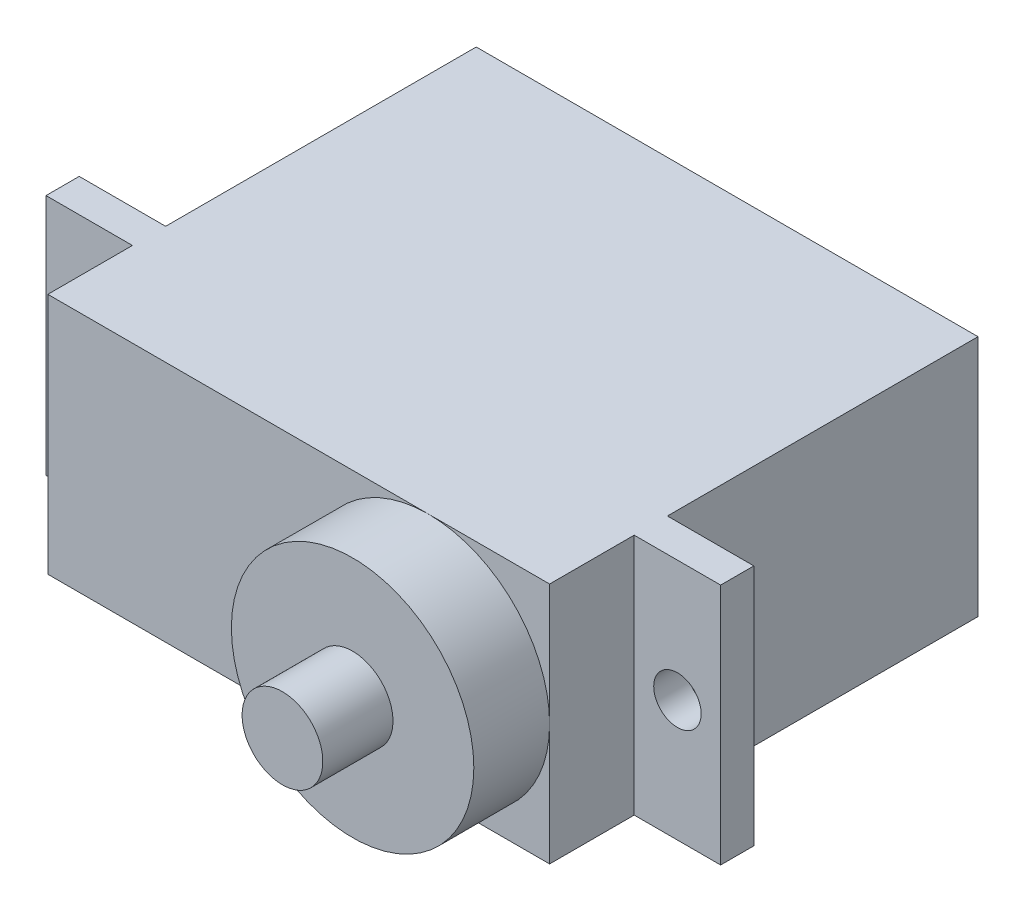
ISO-10303-21;
HEADER;
FILE_DESCRIPTION(('STEP AP214'),'2;1');
FILE_NAME('part.step','',(''),(''),'','','');
FILE_SCHEMA(('AUTOMOTIVE_DESIGN { 1 0 10303 214 1 1 1 1 }'));
ENDSEC;
DATA;
#1=APPLICATION_CONTEXT('core data for automotive mechanical design processes');
#2=APPLICATION_PROTOCOL_DEFINITION('international standard','automotive_design',2000,#1);
#3=PRODUCT_CONTEXT('',#1,'mechanical');
#4=PRODUCT('Part','Part','',(#3));
#5=PRODUCT_RELATED_PRODUCT_CATEGORY('part','',(#4));
#6=PRODUCT_DEFINITION_FORMATION('','',#4);
#7=PRODUCT_DEFINITION_CONTEXT('part definition',#1,'design');
#8=PRODUCT_DEFINITION('design','',#6,#7);
#9=PRODUCT_DEFINITION_SHAPE('','',#8);
#10=(LENGTH_UNIT() NAMED_UNIT(*) SI_UNIT(.MILLI.,.METRE.));
#11=(NAMED_UNIT(*) PLANE_ANGLE_UNIT() SI_UNIT($,.RADIAN.));
#12=(NAMED_UNIT(*) SI_UNIT($,.STERADIAN.) SOLID_ANGLE_UNIT());
#13=UNCERTAINTY_MEASURE_WITH_UNIT(LENGTH_MEASURE(1.E-05),#10,'distance_accuracy_value','');
#14=(GEOMETRIC_REPRESENTATION_CONTEXT(3) GLOBAL_UNCERTAINTY_ASSIGNED_CONTEXT((#13)) GLOBAL_UNIT_ASSIGNED_CONTEXT((#10,
#11,#12)) REPRESENTATION_CONTEXT('',''));
#15=CARTESIAN_POINT('',(0.,0.,0.));
#16=DIRECTION('',(0.,0.,1.));
#17=DIRECTION('',(1.,0.,0.));
#18=AXIS2_PLACEMENT_3D('',#15,#16,#17);
#19=CARTESIAN_POINT('',(0.,0.,20.32));
#20=DIRECTION('',(0.,0.,-1.));
#21=DIRECTION('',(-1.,0.,0.));
#22=AXIS2_PLACEMENT_3D('',#19,#20,#21);
#23=PLANE('',#22);
#24=CARTESIAN_POINT('',(6.15,0.,20.32));
#25=DIRECTION('',(0.,0.,1.));
#26=DIRECTION('',(1.,0.,0.));
#27=AXIS2_PLACEMENT_3D('',#24,#25,#26);
#28=CIRCLE('',#27,5.75);
#29=CARTESIAN_POINT('',(6.15,-5.75,20.32));
#30=VERTEX_POINT('',#29);
#31=CARTESIAN_POINT('',(11.9,0.,20.32));
#32=VERTEX_POINT('',#31);
#33=EDGE_CURVE('E158',#30,#32,#28,.T.);
#34=ORIENTED_EDGE('',*,*,#33,.F.);
#35=DIRECTION('',(1.,0.,0.));
#36=VECTOR('',#35,1.);
#37=CARTESIAN_POINT('',(-11.9,-5.75,20.32));
#38=LINE('',#37,#36);
#39=CARTESIAN_POINT('',(11.9,-5.75,20.32));
#40=VERTEX_POINT('',#39);
#41=EDGE_CURVE('E144',#30,#40,#38,.T.);
#42=ORIENTED_EDGE('',*,*,#41,.T.);
#43=DIRECTION('',(0.,1.,0.));
#44=VECTOR('',#43,1.);
#45=CARTESIAN_POINT('',(11.9,-5.75,20.32));
#46=LINE('',#45,#44);
#47=EDGE_CURVE('E156',#40,#32,#46,.T.);
#48=ORIENTED_EDGE('',*,*,#47,.T.);
#49=EDGE_LOOP('',(#34,#42,#48));
#50=FACE_BOUND('',#49,.T.);
#51=ADVANCED_FACE('F37',(#50),#23,.F.);
#52=CARTESIAN_POINT('',(6.15,5.75,20.32));
#53=VERTEX_POINT('',#52);
#54=EDGE_CURVE('E59',#32,#53,#28,.T.);
#55=ORIENTED_EDGE('',*,*,#54,.F.);
#56=CARTESIAN_POINT('',(11.9,5.75,20.32));
#57=VERTEX_POINT('',#56);
#58=EDGE_CURVE('E238',#32,#57,#46,.T.);
#59=ORIENTED_EDGE('',*,*,#58,.T.);
#60=DIRECTION('',(1.,0.,0.));
#61=VECTOR('',#60,1.);
#62=CARTESIAN_POINT('',(-11.9,5.75,20.32));
#63=LINE('',#62,#61);
#64=EDGE_CURVE('E233',#53,#57,#63,.T.);
#65=ORIENTED_EDGE('',*,*,#64,.F.);
#66=EDGE_LOOP('',(#55,#59,#65));
#67=FACE_BOUND('',#66,.T.);
#68=ADVANCED_FACE('F299',(#67),#23,.F.);
#69=CARTESIAN_POINT('',(-11.9,-5.75,20.32));
#70=DIRECTION('',(-1.,0.,0.));
#71=DIRECTION('',(0.,0.,1.));
#72=AXIS2_PLACEMENT_3D('',#69,#70,#71);
#73=PLANE('',#72);
#74=DIRECTION('',(0.,0.,-1.));
#75=VECTOR('',#74,1.);
#76=CARTESIAN_POINT('',(-11.9,-5.75,20.32));
#77=LINE('',#76,#75);
#78=CARTESIAN_POINT('',(-11.9,-5.75,14.732));
#79=VERTEX_POINT('',#78);
#80=CARTESIAN_POINT('',(-11.9,-5.75,0.));
#81=VERTEX_POINT('',#80);
#82=EDGE_CURVE('E250',#79,#81,#77,.T.);
#83=ORIENTED_EDGE('',*,*,#82,.F.);
#84=DIRECTION('',(0.,1.,0.));
#85=VECTOR('',#84,1.);
#86=CARTESIAN_POINT('',(-11.9,0.,14.732));
#87=LINE('',#86,#85);
#88=CARTESIAN_POINT('',(-11.9,5.75,14.732));
#89=VERTEX_POINT('',#88);
#90=EDGE_CURVE('E174',#79,#89,#87,.T.);
#91=ORIENTED_EDGE('',*,*,#90,.T.);
#92=DIRECTION('',(0.,0.,-1.));
#93=VECTOR('',#92,1.);
#94=CARTESIAN_POINT('',(-11.9,5.75,20.32));
#95=LINE('',#94,#93);
#96=CARTESIAN_POINT('',(-11.9,5.75,0.));
#97=VERTEX_POINT('',#96);
#98=EDGE_CURVE('E143',#89,#97,#95,.T.);
#99=ORIENTED_EDGE('',*,*,#98,.T.);
#100=DIRECTION('',(0.,1.,0.));
#101=VECTOR('',#100,1.);
#102=CARTESIAN_POINT('',(-11.9,-5.75,0.));
#103=LINE('',#102,#101);
#104=EDGE_CURVE('E230',#81,#97,#103,.T.);
#105=ORIENTED_EDGE('',*,*,#104,.F.);
#106=EDGE_LOOP('',(#83,#91,#99,#105));
#107=FACE_BOUND('',#106,.T.);
#108=ADVANCED_FACE('F262',(#107),#73,.T.);
#109=CARTESIAN_POINT('',(11.9,-5.75,20.32));
#110=DIRECTION('',(-1.,0.,0.));
#111=DIRECTION('',(0.,0.,1.));
#112=AXIS2_PLACEMENT_3D('',#109,#110,#111);
#113=PLANE('',#112);
#114=DIRECTION('',(0.,1.,0.));
#115=VECTOR('',#114,1.);
#116=CARTESIAN_POINT('',(11.9,0.,14.732));
#117=LINE('',#116,#115);
#118=CARTESIAN_POINT('',(11.9,-5.75,14.732));
#119=VERTEX_POINT('',#118);
#120=CARTESIAN_POINT('',(11.9,5.75,14.732));
#121=VERTEX_POINT('',#120);
#122=EDGE_CURVE('E224',#119,#121,#117,.T.);
#123=ORIENTED_EDGE('',*,*,#122,.F.);
#124=DIRECTION('',(0.,0.,-1.));
#125=VECTOR('',#124,1.);
#126=CARTESIAN_POINT('',(11.9,-5.75,20.32));
#127=LINE('',#126,#125);
#128=CARTESIAN_POINT('',(11.9,-5.75,0.));
#129=VERTEX_POINT('',#128);
#130=EDGE_CURVE('E252',#119,#129,#127,.T.);
#131=ORIENTED_EDGE('',*,*,#130,.T.);
#132=DIRECTION('',(0.,1.,0.));
#133=VECTOR('',#132,1.);
#134=CARTESIAN_POINT('',(11.9,-5.75,0.));
#135=LINE('',#134,#133);
#136=CARTESIAN_POINT('',(11.9,5.75,0.));
#137=VERTEX_POINT('',#136);
#138=EDGE_CURVE('E245',#129,#137,#135,.T.);
#139=ORIENTED_EDGE('',*,*,#138,.T.);
#140=DIRECTION('',(0.,0.,-1.));
#141=VECTOR('',#140,1.);
#142=CARTESIAN_POINT('',(11.9,5.75,20.32));
#143=LINE('',#142,#141);
#144=EDGE_CURVE('E255',#121,#137,#143,.T.);
#145=ORIENTED_EDGE('',*,*,#144,.F.);
#146=EDGE_LOOP('',(#123,#131,#139,#145));
#147=FACE_BOUND('',#146,.T.);
#148=ADVANCED_FACE('F289',(#147),#113,.F.);
#149=DIRECTION('',(0.,1.,0.));
#150=VECTOR('',#149,1.);
#151=CARTESIAN_POINT('',(-11.9,0.,16.3068));
#152=LINE('',#151,#150);
#153=CARTESIAN_POINT('',(-11.9,-5.75,16.3068));
#154=VERTEX_POINT('',#153);
#155=CARTESIAN_POINT('',(-11.9,5.75,16.3068));
#156=VERTEX_POINT('',#155);
#157=EDGE_CURVE('E181',#154,#156,#152,.T.);
#158=ORIENTED_EDGE('',*,*,#157,.F.);
#159=CARTESIAN_POINT('',(-11.9,-5.75,20.32));
#160=VERTEX_POINT('',#159);
#161=EDGE_CURVE('E45',#160,#154,#77,.T.);
#162=ORIENTED_EDGE('',*,*,#161,.F.);
#163=DIRECTION('',(0.,1.,0.));
#164=VECTOR('',#163,1.);
#165=CARTESIAN_POINT('',(-11.9,-5.75,20.32));
#166=LINE('',#165,#164);
#167=CARTESIAN_POINT('',(-11.9,5.75,20.32));
#168=VERTEX_POINT('',#167);
#169=EDGE_CURVE('E140',#160,#168,#166,.T.);
#170=ORIENTED_EDGE('',*,*,#169,.T.);
#171=EDGE_CURVE('E256',#168,#156,#95,.T.);
#172=ORIENTED_EDGE('',*,*,#171,.T.);
#173=EDGE_LOOP('',(#158,#162,#170,#172));
#174=FACE_BOUND('',#173,.T.);
#175=ADVANCED_FACE('F39',(#174),#73,.T.);
#176=CARTESIAN_POINT('',(-11.9,-5.75,20.32));
#177=DIRECTION('',(0.,1.,0.));
#178=DIRECTION('',(0.,0.,1.));
#179=AXIS2_PLACEMENT_3D('',#176,#177,#178);
#180=PLANE('',#179);
#181=DIRECTION('',(1.,0.,0.));
#182=VECTOR('',#181,1.);
#183=CARTESIAN_POINT('',(-11.9,-5.75,0.));
#184=LINE('',#183,#182);
#185=EDGE_CURVE('E234',#81,#129,#184,.T.);
#186=ORIENTED_EDGE('',*,*,#185,.T.);
#187=ORIENTED_EDGE('',*,*,#130,.F.);
#188=DIRECTION('',(-1.,0.,0.));
#189=VECTOR('',#188,1.);
#190=CARTESIAN_POINT('',(0.,-5.75,14.732));
#191=LINE('',#190,#189);
#192=CARTESIAN_POINT('',(16.,-5.75,14.732));
#193=VERTEX_POINT('',#192);
#194=EDGE_CURVE('E222',#193,#119,#191,.T.);
#195=ORIENTED_EDGE('',*,*,#194,.F.);
#196=DIRECTION('',(0.,0.,-1.));
#197=VECTOR('',#196,1.);
#198=CARTESIAN_POINT('',(16.,-5.75,16.3068));
#199=LINE('',#198,#197);
#200=CARTESIAN_POINT('',(16.,-5.75,16.3068));
#201=VERTEX_POINT('',#200);
#202=EDGE_CURVE('E216',#201,#193,#199,.T.);
#203=ORIENTED_EDGE('',*,*,#202,.F.);
#204=DIRECTION('',(-1.,0.,0.));
#205=VECTOR('',#204,1.);
#206=CARTESIAN_POINT('',(0.,-5.75,16.3068));
#207=LINE('',#206,#205);
#208=CARTESIAN_POINT('',(11.9,-5.75,16.3068));
#209=VERTEX_POINT('',#208);
#210=EDGE_CURVE('E208',#201,#209,#207,.T.);
#211=ORIENTED_EDGE('',*,*,#210,.T.);
#212=EDGE_CURVE('E152',#40,#209,#127,.T.);
#213=ORIENTED_EDGE('',*,*,#212,.F.);
#214=ORIENTED_EDGE('',*,*,#41,.F.);
#215=EDGE_CURVE('E136',#160,#30,#38,.T.);
#216=ORIENTED_EDGE('',*,*,#215,.F.);
#217=ORIENTED_EDGE('',*,*,#161,.T.);
#218=DIRECTION('',(1.,0.,0.));
#219=VECTOR('',#218,1.);
#220=CARTESIAN_POINT('',(0.,-5.75,16.3068));
#221=LINE('',#220,#219);
#222=CARTESIAN_POINT('',(-16.,-5.75,16.3068));
#223=VERTEX_POINT('',#222);
#224=EDGE_CURVE('E173',#223,#154,#221,.T.);
#225=ORIENTED_EDGE('',*,*,#224,.F.);
#226=DIRECTION('',(0.,0.,-1.));
#227=VECTOR('',#226,1.);
#228=CARTESIAN_POINT('',(-16.,-5.75,16.3068));
#229=LINE('',#228,#227);
#230=CARTESIAN_POINT('',(-16.,-5.75,14.732));
#231=VERTEX_POINT('',#230);
#232=EDGE_CURVE('E184',#223,#231,#229,.T.);
#233=ORIENTED_EDGE('',*,*,#232,.T.);
#234=DIRECTION('',(1.,0.,0.));
#235=VECTOR('',#234,1.);
#236=CARTESIAN_POINT('',(0.,-5.75,14.732));
#237=LINE('',#236,#235);
#238=EDGE_CURVE('E187',#231,#79,#237,.T.);
#239=ORIENTED_EDGE('',*,*,#238,.T.);
#240=ORIENTED_EDGE('',*,*,#82,.T.);
#241=EDGE_LOOP('',(#186,#187,#195,#203,#211,#213,#214,#216,#217,#225,#233,#239,#240));
#242=FACE_BOUND('',#241,.T.);
#243=ADVANCED_FACE('F149',(#242),#180,.F.);
#244=ORIENTED_EDGE('',*,*,#212,.T.);
#245=DIRECTION('',(0.,1.,0.));
#246=VECTOR('',#245,1.);
#247=CARTESIAN_POINT('',(11.9,0.,16.3068));
#248=LINE('',#247,#246);
#249=CARTESIAN_POINT('',(11.9,5.75,16.3068));
#250=VERTEX_POINT('',#249);
#251=EDGE_CURVE('E210',#209,#250,#248,.T.);
#252=ORIENTED_EDGE('',*,*,#251,.T.);
#253=EDGE_CURVE('E253',#57,#250,#143,.T.);
#254=ORIENTED_EDGE('',*,*,#253,.F.);
#255=ORIENTED_EDGE('',*,*,#58,.F.);
#256=ORIENTED_EDGE('',*,*,#47,.F.);
#257=EDGE_LOOP('',(#244,#252,#254,#255,#256));
#258=FACE_BOUND('',#257,.T.);
#259=ADVANCED_FACE('F294',(#258),#113,.F.);
#260=CARTESIAN_POINT('',(-11.9,5.75,20.32));
#261=DIRECTION('',(0.,1.,0.));
#262=DIRECTION('',(0.,0.,1.));
#263=AXIS2_PLACEMENT_3D('',#260,#261,#262);
#264=PLANE('',#263);
#265=DIRECTION('',(1.,0.,0.));
#266=VECTOR('',#265,1.);
#267=CARTESIAN_POINT('',(-11.9,5.75,0.));
#268=LINE('',#267,#266);
#269=EDGE_CURVE('E242',#97,#137,#268,.T.);
#270=ORIENTED_EDGE('',*,*,#269,.F.);
#271=ORIENTED_EDGE('',*,*,#98,.F.);
#272=DIRECTION('',(-1.,0.,0.));
#273=VECTOR('',#272,1.);
#274=CARTESIAN_POINT('',(0.,5.75000000000001,14.732));
#275=LINE('',#274,#273);
#276=CARTESIAN_POINT('',(-16.,5.75,14.732));
#277=VERTEX_POINT('',#276);
#278=EDGE_CURVE('E192',#89,#277,#275,.T.);
#279=ORIENTED_EDGE('',*,*,#278,.T.);
#280=DIRECTION('',(0.,0.,-1.));
#281=VECTOR('',#280,1.);
#282=CARTESIAN_POINT('',(-16.,5.75,16.3068));
#283=LINE('',#282,#281);
#284=CARTESIAN_POINT('',(-16.,5.75,16.3068));
#285=VERTEX_POINT('',#284);
#286=EDGE_CURVE('E195',#285,#277,#283,.T.);
#287=ORIENTED_EDGE('',*,*,#286,.F.);
#288=DIRECTION('',(-1.,0.,0.));
#289=VECTOR('',#288,1.);
#290=CARTESIAN_POINT('',(0.,5.75000000000001,16.3068));
#291=LINE('',#290,#289);
#292=EDGE_CURVE('E179',#156,#285,#291,.T.);
#293=ORIENTED_EDGE('',*,*,#292,.F.);
#294=ORIENTED_EDGE('',*,*,#171,.F.);
#295=EDGE_CURVE('E235',#168,#53,#63,.T.);
#296=ORIENTED_EDGE('',*,*,#295,.T.);
#297=ORIENTED_EDGE('',*,*,#64,.T.);
#298=ORIENTED_EDGE('',*,*,#253,.T.);
#299=DIRECTION('',(1.,0.,0.));
#300=VECTOR('',#299,1.);
#301=CARTESIAN_POINT('',(0.,5.75000000000001,16.3068));
#302=LINE('',#301,#300);
#303=CARTESIAN_POINT('',(16.,5.75,16.3068));
#304=VERTEX_POINT('',#303);
#305=EDGE_CURVE('E213',#250,#304,#302,.T.);
#306=ORIENTED_EDGE('',*,*,#305,.T.);
#307=DIRECTION('',(0.,0.,-1.));
#308=VECTOR('',#307,1.);
#309=CARTESIAN_POINT('',(16.,5.75,16.3068));
#310=LINE('',#309,#308);
#311=CARTESIAN_POINT('',(16.,5.75,14.732));
#312=VERTEX_POINT('',#311);
#313=EDGE_CURVE('E228',#304,#312,#310,.T.);
#314=ORIENTED_EDGE('',*,*,#313,.T.);
#315=DIRECTION('',(1.,0.,0.));
#316=VECTOR('',#315,1.);
#317=CARTESIAN_POINT('',(0.,5.75000000000001,14.732));
#318=LINE('',#317,#316);
#319=EDGE_CURVE('E205',#121,#312,#318,.T.);
#320=ORIENTED_EDGE('',*,*,#319,.F.);
#321=ORIENTED_EDGE('',*,*,#144,.T.);
#322=EDGE_LOOP('',(#270,#271,#279,#287,#293,#294,#296,#297,#298,#306,#314,#320,#321));
#323=FACE_BOUND('',#322,.T.);
#324=ADVANCED_FACE('F266',(#323),#264,.T.);
#325=EDGE_CURVE('E52',#53,#30,#28,.T.);
#326=ORIENTED_EDGE('',*,*,#325,.F.);
#327=ORIENTED_EDGE('',*,*,#295,.F.);
#328=ORIENTED_EDGE('',*,*,#169,.F.);
#329=ORIENTED_EDGE('',*,*,#215,.T.);
#330=EDGE_LOOP('',(#326,#327,#328,#329));
#331=FACE_BOUND('',#330,.T.);
#332=ADVANCED_FACE('F138',(#331),#23,.F.);
#333=CARTESIAN_POINT('',(0.,0.,0.));
#334=DIRECTION('',(0.,0.,-1.));
#335=DIRECTION('',(-1.,0.,0.));
#336=AXIS2_PLACEMENT_3D('',#333,#334,#335);
#337=PLANE('',#336);
#338=ORIENTED_EDGE('',*,*,#104,.T.);
#339=ORIENTED_EDGE('',*,*,#269,.T.);
#340=ORIENTED_EDGE('',*,*,#138,.F.);
#341=ORIENTED_EDGE('',*,*,#185,.F.);
#342=EDGE_LOOP('',(#338,#339,#340,#341));
#343=FACE_BOUND('',#342,.T.);
#344=ADVANCED_FACE('F272',(#343),#337,.T.);
#345=CARTESIAN_POINT('',(16.,0.,16.3068));
#346=DIRECTION('',(1.,0.,0.));
#347=DIRECTION('',(0.,0.,-1.));
#348=AXIS2_PLACEMENT_3D('',#345,#346,#347);
#349=PLANE('',#348);
#350=DIRECTION('',(0.,-1.,0.));
#351=VECTOR('',#350,1.);
#352=CARTESIAN_POINT('',(16.,0.,14.732));
#353=LINE('',#352,#351);
#354=EDGE_CURVE('E219',#312,#193,#353,.T.);
#355=ORIENTED_EDGE('',*,*,#354,.F.);
#356=ORIENTED_EDGE('',*,*,#313,.F.);
#357=DIRECTION('',(0.,-1.,0.));
#358=VECTOR('',#357,1.);
#359=CARTESIAN_POINT('',(16.,0.,16.3068));
#360=LINE('',#359,#358);
#361=EDGE_CURVE('E204',#304,#201,#360,.T.);
#362=ORIENTED_EDGE('',*,*,#361,.T.);
#363=ORIENTED_EDGE('',*,*,#202,.T.);
#364=EDGE_LOOP('',(#355,#356,#362,#363));
#365=FACE_BOUND('',#364,.T.);
#366=ADVANCED_FACE('F312',(#365),#349,.T.);
#367=CARTESIAN_POINT('',(13.95,0.,16.3068));
#368=DIRECTION('',(0.,0.,-1.));
#369=DIRECTION('',(-1.,0.,0.));
#370=AXIS2_PLACEMENT_3D('',#367,#368,#369);
#371=CYLINDRICAL_SURFACE('',#370,1.125);
#372=CARTESIAN_POINT('',(13.95,0.,16.3068));
#373=DIRECTION('',(0.,0.,-1.));
#374=DIRECTION('',(-1.,0.,0.));
#375=AXIS2_PLACEMENT_3D('',#372,#373,#374);
#376=CIRCLE('',#375,1.125);
#377=CARTESIAN_POINT('',(12.825,0.,16.3068));
#378=VERTEX_POINT('',#377);
#379=EDGE_CURVE('E201',#378,#378,#376,.T.);
#380=ORIENTED_EDGE('',*,*,#379,.F.);
#381=EDGE_LOOP('',(#380));
#382=FACE_BOUND('',#381,.T.);
#383=CARTESIAN_POINT('',(13.95,0.,14.732));
#384=DIRECTION('',(0.,0.,-1.));
#385=DIRECTION('',(-1.,0.,0.));
#386=AXIS2_PLACEMENT_3D('',#383,#384,#385);
#387=CIRCLE('',#386,1.125);
#388=CARTESIAN_POINT('',(12.825,0.,14.732));
#389=VERTEX_POINT('',#388);
#390=EDGE_CURVE('E198',#389,#389,#387,.T.);
#391=ORIENTED_EDGE('',*,*,#390,.T.);
#392=EDGE_LOOP('',(#391));
#393=FACE_BOUND('',#392,.T.);
#394=ADVANCED_FACE('F339',(#382,#393),#371,.F.);
#395=CARTESIAN_POINT('',(0.,0.,16.3068));
#396=DIRECTION('',(0.,0.,-1.));
#397=DIRECTION('',(-1.,0.,0.));
#398=AXIS2_PLACEMENT_3D('',#395,#396,#397);
#399=PLANE('',#398);
#400=ORIENTED_EDGE('',*,*,#379,.T.);
#401=EDGE_LOOP('',(#400));
#402=FACE_BOUND('',#401,.T.);
#403=ORIENTED_EDGE('',*,*,#361,.F.);
#404=ORIENTED_EDGE('',*,*,#305,.F.);
#405=ORIENTED_EDGE('',*,*,#251,.F.);
#406=ORIENTED_EDGE('',*,*,#210,.F.);
#407=EDGE_LOOP('',(#403,#404,#405,#406));
#408=FACE_BOUND('',#407,.T.);
#409=ADVANCED_FACE('F323',(#402,#408),#399,.F.);
#410=CARTESIAN_POINT('',(0.,0.,14.732));
#411=DIRECTION('',(0.,0.,-1.));
#412=DIRECTION('',(-1.,0.,0.));
#413=AXIS2_PLACEMENT_3D('',#410,#411,#412);
#414=PLANE('',#413);
#415=ORIENTED_EDGE('',*,*,#390,.F.);
#416=EDGE_LOOP('',(#415));
#417=FACE_BOUND('',#416,.T.);
#418=ORIENTED_EDGE('',*,*,#354,.T.);
#419=ORIENTED_EDGE('',*,*,#194,.T.);
#420=ORIENTED_EDGE('',*,*,#122,.T.);
#421=ORIENTED_EDGE('',*,*,#319,.T.);
#422=EDGE_LOOP('',(#418,#419,#420,#421));
#423=FACE_BOUND('',#422,.T.);
#424=ADVANCED_FACE('F327',(#417,#423),#414,.T.);
#425=CARTESIAN_POINT('',(-13.95,0.,16.3068));
#426=DIRECTION('',(0.,0.,-1.));
#427=DIRECTION('',(-1.,0.,0.));
#428=AXIS2_PLACEMENT_3D('',#425,#426,#427);
#429=CYLINDRICAL_SURFACE('',#428,1.125);
#430=CARTESIAN_POINT('',(-13.95,0.,16.3068));
#431=DIRECTION('',(0.,0.,-1.));
#432=DIRECTION('',(-1.,0.,0.));
#433=AXIS2_PLACEMENT_3D('',#430,#431,#432);
#434=CIRCLE('',#433,1.125);
#435=CARTESIAN_POINT('',(-15.075,0.,16.3068));
#436=VERTEX_POINT('',#435);
#437=EDGE_CURVE('E170',#436,#436,#434,.T.);
#438=ORIENTED_EDGE('',*,*,#437,.F.);
#439=EDGE_LOOP('',(#438));
#440=FACE_BOUND('',#439,.T.);
#441=CARTESIAN_POINT('',(-13.95,0.,14.732));
#442=DIRECTION('',(0.,0.,-1.));
#443=DIRECTION('',(-1.,0.,0.));
#444=AXIS2_PLACEMENT_3D('',#441,#442,#443);
#445=CIRCLE('',#444,1.125);
#446=CARTESIAN_POINT('',(-15.075,0.,14.732));
#447=VERTEX_POINT('',#446);
#448=EDGE_CURVE('E169',#447,#447,#445,.T.);
#449=ORIENTED_EDGE('',*,*,#448,.T.);
#450=EDGE_LOOP('',(#449));
#451=FACE_BOUND('',#450,.T.);
#452=ADVANCED_FACE('F330',(#440,#451),#429,.F.);
#453=CARTESIAN_POINT('',(-16.,0.,16.3068));
#454=DIRECTION('',(1.,0.,0.));
#455=DIRECTION('',(0.,0.,-1.));
#456=AXIS2_PLACEMENT_3D('',#453,#454,#455);
#457=PLANE('',#456);
#458=DIRECTION('',(0.,-1.,0.));
#459=VECTOR('',#458,1.);
#460=CARTESIAN_POINT('',(-16.,0.,14.732));
#461=LINE('',#460,#459);
#462=EDGE_CURVE('E190',#277,#231,#461,.T.);
#463=ORIENTED_EDGE('',*,*,#462,.T.);
#464=ORIENTED_EDGE('',*,*,#232,.F.);
#465=DIRECTION('',(0.,-1.,0.));
#466=VECTOR('',#465,1.);
#467=CARTESIAN_POINT('',(-16.,0.,16.3068));
#468=LINE('',#467,#466);
#469=EDGE_CURVE('E177',#285,#223,#468,.T.);
#470=ORIENTED_EDGE('',*,*,#469,.F.);
#471=ORIENTED_EDGE('',*,*,#286,.T.);
#472=EDGE_LOOP('',(#463,#464,#470,#471));
#473=FACE_BOUND('',#472,.T.);
#474=ADVANCED_FACE('F283',(#473),#457,.F.);
#475=CARTESIAN_POINT('',(0.,0.,16.3068));
#476=DIRECTION('',(0.,0.,-1.));
#477=DIRECTION('',(-1.,0.,0.));
#478=AXIS2_PLACEMENT_3D('',#475,#476,#477);
#479=PLANE('',#478);
#480=ORIENTED_EDGE('',*,*,#437,.T.);
#481=EDGE_LOOP('',(#480));
#482=FACE_BOUND('',#481,.T.);
#483=ORIENTED_EDGE('',*,*,#224,.T.);
#484=ORIENTED_EDGE('',*,*,#157,.T.);
#485=ORIENTED_EDGE('',*,*,#292,.T.);
#486=ORIENTED_EDGE('',*,*,#469,.T.);
#487=EDGE_LOOP('',(#483,#484,#485,#486));
#488=FACE_BOUND('',#487,.T.);
#489=ADVANCED_FACE('F287',(#482,#488),#479,.F.);
#490=CARTESIAN_POINT('',(0.,0.,14.732));
#491=DIRECTION('',(0.,0.,-1.));
#492=DIRECTION('',(-1.,0.,0.));
#493=AXIS2_PLACEMENT_3D('',#490,#491,#492);
#494=PLANE('',#493);
#495=ORIENTED_EDGE('',*,*,#448,.F.);
#496=EDGE_LOOP('',(#495));
#497=FACE_BOUND('',#496,.T.);
#498=ORIENTED_EDGE('',*,*,#238,.F.);
#499=ORIENTED_EDGE('',*,*,#462,.F.);
#500=ORIENTED_EDGE('',*,*,#278,.F.);
#501=ORIENTED_EDGE('',*,*,#90,.F.);
#502=EDGE_LOOP('',(#498,#499,#500,#501));
#503=FACE_BOUND('',#502,.T.);
#504=ADVANCED_FACE('F277',(#497,#503),#494,.T.);
#505=CARTESIAN_POINT('',(6.15,0.,40.1775559672906));
#506=DIRECTION('',(0.,0.,-1.));
#507=DIRECTION('',(-1.,0.,0.));
#508=AXIS2_PLACEMENT_3D('',#505,#506,#507);
#509=CYLINDRICAL_SURFACE('',#508,5.75);
#510=CARTESIAN_POINT('',(6.15,0.,23.9141));
#511=DIRECTION('',(0.,0.,-1.));
#512=DIRECTION('',(-1.,0.,0.));
#513=AXIS2_PLACEMENT_3D('',#510,#511,#512);
#514=CIRCLE('',#513,5.75);
#515=CARTESIAN_POINT('',(0.400000000000004,0.,23.9141));
#516=VERTEX_POINT('',#515);
#517=EDGE_CURVE('E162',#516,#516,#514,.T.);
#518=ORIENTED_EDGE('',*,*,#517,.T.);
#519=EDGE_LOOP('',(#518));
#520=FACE_BOUND('',#519,.T.);
#521=ORIENTED_EDGE('',*,*,#54,.T.);
#522=ORIENTED_EDGE('',*,*,#325,.T.);
#523=ORIENTED_EDGE('',*,*,#33,.T.);
#524=EDGE_LOOP('',(#521,#522,#523));
#525=FACE_BOUND('',#524,.T.);
#526=ADVANCED_FACE('F161',(#520,#525),#509,.T.);
#527=CARTESIAN_POINT('',(0.,0.,23.9141));
#528=DIRECTION('',(0.,0.,-1.));
#529=DIRECTION('',(-1.,0.,0.));
#530=AXIS2_PLACEMENT_3D('',#527,#528,#529);
#531=PLANE('',#530);
#532=CARTESIAN_POINT('',(6.15,0.,23.9141));
#533=DIRECTION('',(0.,0.,-1.));
#534=DIRECTION('',(-1.,0.,0.));
#535=AXIS2_PLACEMENT_3D('',#532,#533,#534);
#536=CIRCLE('',#535,1.915);
#537=CARTESIAN_POINT('',(4.235,0.,23.9141));
#538=VERTEX_POINT('',#537);
#539=EDGE_CURVE('E11',#538,#538,#536,.T.);
#540=ORIENTED_EDGE('',*,*,#539,.T.);
#541=EDGE_LOOP('',(#540));
#542=FACE_BOUND('',#541,.T.);
#543=ORIENTED_EDGE('',*,*,#517,.F.);
#544=EDGE_LOOP('',(#543));
#545=FACE_BOUND('',#544,.T.);
#546=ADVANCED_FACE('F404',(#542,#545),#531,.F.);
#547=CARTESIAN_POINT('',(0.,0.,27.2415));
#548=DIRECTION('',(0.,0.,-1.));
#549=DIRECTION('',(-1.,0.,0.));
#550=AXIS2_PLACEMENT_3D('',#547,#548,#549);
#551=PLANE('',#550);
#552=CARTESIAN_POINT('',(6.15,0.,27.2415));
#553=DIRECTION('',(0.,0.,-1.));
#554=DIRECTION('',(-1.,0.,0.));
#555=AXIS2_PLACEMENT_3D('',#552,#553,#554);
#556=CIRCLE('',#555,1.915);
#557=CARTESIAN_POINT('',(4.235,0.,27.2415));
#558=VERTEX_POINT('',#557);
#559=EDGE_CURVE('E166',#558,#558,#556,.T.);
#560=ORIENTED_EDGE('',*,*,#559,.F.);
#561=EDGE_LOOP('',(#560));
#562=FACE_BOUND('',#561,.T.);
#563=ADVANCED_FACE('F400',(#562),#551,.F.);
#564=CARTESIAN_POINT('',(6.15,0.,32.657937943889));
#565=DIRECTION('',(0.,0.,-1.));
#566=DIRECTION('',(-1.,0.,0.));
#567=AXIS2_PLACEMENT_3D('',#564,#565,#566);
#568=CYLINDRICAL_SURFACE('',#567,1.915);
#569=ORIENTED_EDGE('',*,*,#559,.T.);
#570=EDGE_LOOP('',(#569));
#571=FACE_BOUND('',#570,.T.);
#572=ORIENTED_EDGE('',*,*,#539,.F.);
#573=EDGE_LOOP('',(#572));
#574=FACE_BOUND('',#573,.T.);
#575=ADVANCED_FACE('F403',(#571,#574),#568,.T.);
#576=CLOSED_SHELL('',(#51,#68,#108,#148,#175,#243,#259,#324,#332,#344,#366,#394,#409,#424,#452,
#474,#489,#504,#526,#546,#563,#575));
#577=MANIFOLD_SOLID_BREP('B2',#576);
#578=ADVANCED_BREP_SHAPE_REPRESENTATION('',(#18,#577),#14);
#579=SHAPE_DEFINITION_REPRESENTATION(#9,#578);
ENDSEC;
END-ISO-10303-21;
